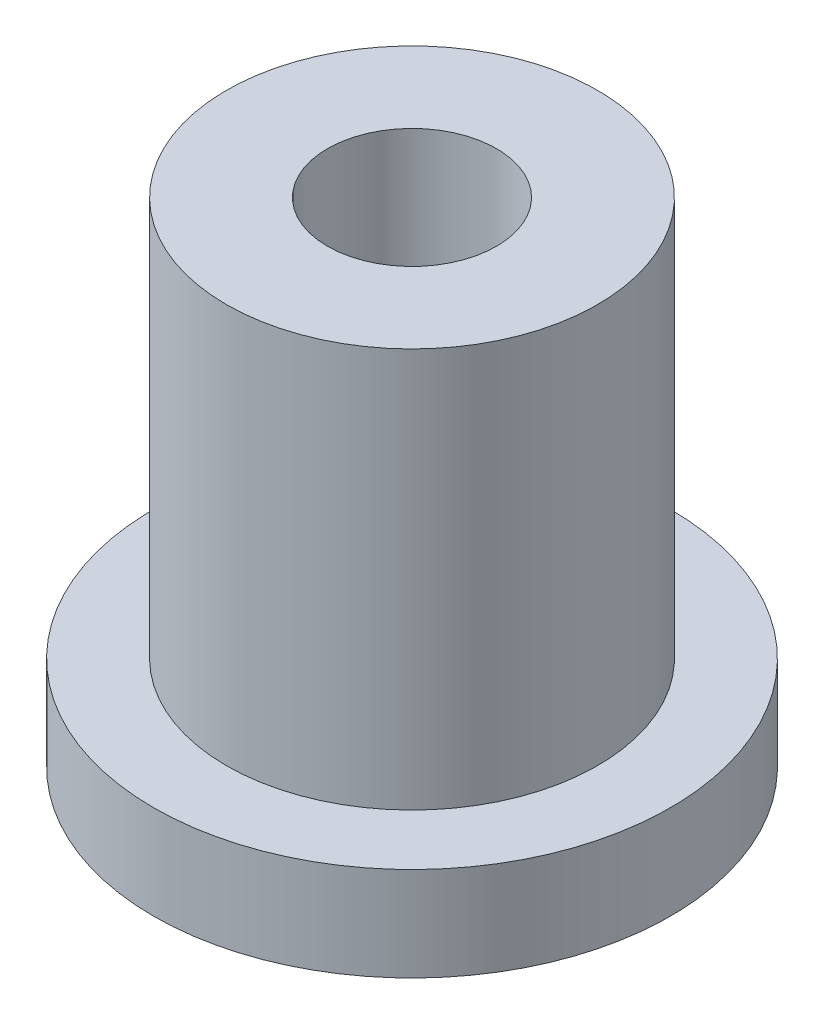
ISO-10303-21;
HEADER;
FILE_DESCRIPTION(('STEP AP214'),'2;1');
FILE_NAME('part.step','',(''),(''),'','','');
FILE_SCHEMA(('AUTOMOTIVE_DESIGN { 1 0 10303 214 1 1 1 1 }'));
ENDSEC;
DATA;
#1=APPLICATION_CONTEXT('core data for automotive mechanical design processes');
#2=APPLICATION_PROTOCOL_DEFINITION('international standard','automotive_design',2000,#1);
#3=PRODUCT_CONTEXT('',#1,'mechanical');
#4=PRODUCT('Part','Part','',(#3));
#5=PRODUCT_RELATED_PRODUCT_CATEGORY('part','',(#4));
#6=PRODUCT_DEFINITION_FORMATION('','',#4);
#7=PRODUCT_DEFINITION_CONTEXT('part definition',#1,'design');
#8=PRODUCT_DEFINITION('design','',#6,#7);
#9=PRODUCT_DEFINITION_SHAPE('','',#8);
#10=(LENGTH_UNIT() NAMED_UNIT(*) SI_UNIT(.MILLI.,.METRE.));
#11=(NAMED_UNIT(*) PLANE_ANGLE_UNIT() SI_UNIT($,.RADIAN.));
#12=(NAMED_UNIT(*) SI_UNIT($,.STERADIAN.) SOLID_ANGLE_UNIT());
#13=UNCERTAINTY_MEASURE_WITH_UNIT(LENGTH_MEASURE(1.E-05),#10,'distance_accuracy_value','');
#14=(GEOMETRIC_REPRESENTATION_CONTEXT(3) GLOBAL_UNCERTAINTY_ASSIGNED_CONTEXT((#13)) GLOBAL_UNIT_ASSIGNED_CONTEXT((#10,
#11,#12)) REPRESENTATION_CONTEXT('',''));
#15=CARTESIAN_POINT('',(0.,0.,0.));
#16=DIRECTION('',(0.,0.,1.));
#17=DIRECTION('',(1.,0.,0.));
#18=AXIS2_PLACEMENT_3D('',#15,#16,#17);
#19=CARTESIAN_POINT('',(0.,2.,0.));
#20=DIRECTION('',(0.,1.,0.));
#21=DIRECTION('',(0.,0.,1.));
#22=AXIS2_PLACEMENT_3D('',#19,#20,#21);
#23=PLANE('',#22);
#24=CARTESIAN_POINT('',(0.,2.,0.));
#25=DIRECTION('',(0.,1.,0.));
#26=DIRECTION('',(0.,0.,1.));
#27=AXIS2_PLACEMENT_3D('',#24,#25,#26);
#28=CIRCLE('',#27,3.95);
#29=CARTESIAN_POINT('',(0.,2.,3.95));
#30=VERTEX_POINT('',#29);
#31=EDGE_CURVE('E10',#30,#30,#28,.T.);
#32=ORIENTED_EDGE('',*,*,#31,.F.);
#33=EDGE_LOOP('',(#32));
#34=FACE_BOUND('',#33,.T.);
#35=CARTESIAN_POINT('',(0.,2.,0.));
#36=DIRECTION('',(0.,1.,0.));
#37=DIRECTION('',(0.,0.,1.));
#38=AXIS2_PLACEMENT_3D('',#35,#36,#37);
#39=CIRCLE('',#38,5.5);
#40=CARTESIAN_POINT('',(0.,2.,5.5));
#41=VERTEX_POINT('',#40);
#42=EDGE_CURVE('E46',#41,#41,#39,.T.);
#43=ORIENTED_EDGE('',*,*,#42,.T.);
#44=EDGE_LOOP('',(#43));
#45=FACE_BOUND('',#44,.T.);
#46=ADVANCED_FACE('F37',(#34,#45),#23,.T.);
#47=CARTESIAN_POINT('',(0.,0.,0.));
#48=DIRECTION('',(0.,1.,0.));
#49=DIRECTION('',(0.,0.,1.));
#50=AXIS2_PLACEMENT_3D('',#47,#48,#49);
#51=PLANE('',#50);
#52=CARTESIAN_POINT('',(0.,0.,0.));
#53=DIRECTION('',(0.,1.,0.));
#54=DIRECTION('',(0.,0.,1.));
#55=AXIS2_PLACEMENT_3D('',#52,#53,#54);
#56=CIRCLE('',#55,5.5);
#57=CARTESIAN_POINT('',(0.,0.,5.5));
#58=VERTEX_POINT('',#57);
#59=EDGE_CURVE('E41',#58,#58,#56,.T.);
#60=ORIENTED_EDGE('',*,*,#59,.F.);
#61=EDGE_LOOP('',(#60));
#62=FACE_BOUND('',#61,.T.);
#63=CARTESIAN_POINT('',(0.,0.,0.));
#64=DIRECTION('',(0.,1.,0.));
#65=DIRECTION('',(0.,0.,1.));
#66=AXIS2_PLACEMENT_3D('',#63,#64,#65);
#67=CIRCLE('',#66,1.8);
#68=CARTESIAN_POINT('',(0.,0.,1.8));
#69=VERTEX_POINT('',#68);
#70=EDGE_CURVE('E56',#69,#69,#67,.T.);
#71=ORIENTED_EDGE('',*,*,#70,.T.);
#72=EDGE_LOOP('',(#71));
#73=FACE_BOUND('',#72,.T.);
#74=ADVANCED_FACE('F87',(#62,#73),#51,.F.);
#75=CARTESIAN_POINT('',(0.,2.,0.));
#76=DIRECTION('',(0.,-1.,0.));
#77=DIRECTION('',(0.,0.,-1.));
#78=AXIS2_PLACEMENT_3D('',#75,#76,#77);
#79=CYLINDRICAL_SURFACE('',#78,5.5);
#80=ORIENTED_EDGE('',*,*,#42,.F.);
#81=EDGE_LOOP('',(#80));
#82=FACE_BOUND('',#81,.T.);
#83=ORIENTED_EDGE('',*,*,#59,.T.);
#84=EDGE_LOOP('',(#83));
#85=FACE_BOUND('',#84,.T.);
#86=ADVANCED_FACE('F39',(#82,#85),#79,.T.);
#87=CARTESIAN_POINT('',(0.,2.,0.));
#88=DIRECTION('',(0.,-1.,0.));
#89=DIRECTION('',(0.,0.,-1.));
#90=AXIS2_PLACEMENT_3D('',#87,#88,#89);
#91=CYLINDRICAL_SURFACE('',#90,1.8);
#92=ORIENTED_EDGE('',*,*,#70,.F.);
#93=EDGE_LOOP('',(#92));
#94=FACE_BOUND('',#93,.T.);
#95=CARTESIAN_POINT('',(0.,10.5,0.));
#96=DIRECTION('',(0.,1.,0.));
#97=DIRECTION('',(0.,0.,1.));
#98=AXIS2_PLACEMENT_3D('',#95,#96,#97);
#99=CIRCLE('',#98,1.8);
#100=CARTESIAN_POINT('',(0.,10.5,1.8));
#101=VERTEX_POINT('',#100);
#102=EDGE_CURVE('E65',#101,#101,#99,.T.);
#103=ORIENTED_EDGE('',*,*,#102,.T.);
#104=EDGE_LOOP('',(#103));
#105=FACE_BOUND('',#104,.T.);
#106=ADVANCED_FACE('F72',(#94,#105),#91,.F.);
#107=CARTESIAN_POINT('',(0.,10.5,0.));
#108=DIRECTION('',(0.,1.,0.));
#109=DIRECTION('',(0.,0.,1.));
#110=AXIS2_PLACEMENT_3D('',#107,#108,#109);
#111=PLANE('',#110);
#112=CARTESIAN_POINT('',(0.,10.5,0.));
#113=DIRECTION('',(0.,1.,0.));
#114=DIRECTION('',(0.,0.,1.));
#115=AXIS2_PLACEMENT_3D('',#112,#113,#114);
#116=CIRCLE('',#115,3.95);
#117=CARTESIAN_POINT('',(0.,10.5,3.95));
#118=VERTEX_POINT('',#117);
#119=EDGE_CURVE('E54',#118,#118,#116,.T.);
#120=ORIENTED_EDGE('',*,*,#119,.T.);
#121=EDGE_LOOP('',(#120));
#122=FACE_BOUND('',#121,.T.);
#123=ORIENTED_EDGE('',*,*,#102,.F.);
#124=EDGE_LOOP('',(#123));
#125=FACE_BOUND('',#124,.T.);
#126=ADVANCED_FACE('F74',(#122,#125),#111,.T.);
#127=CARTESIAN_POINT('',(0.,10.5,0.));
#128=DIRECTION('',(0.,-1.,0.));
#129=DIRECTION('',(0.,0.,-1.));
#130=AXIS2_PLACEMENT_3D('',#127,#128,#129);
#131=CYLINDRICAL_SURFACE('',#130,3.95);
#132=ORIENTED_EDGE('',*,*,#119,.F.);
#133=EDGE_LOOP('',(#132));
#134=FACE_BOUND('',#133,.T.);
#135=ORIENTED_EDGE('',*,*,#31,.T.);
#136=EDGE_LOOP('',(#135));
#137=FACE_BOUND('',#136,.T.);
#138=ADVANCED_FACE('F76',(#134,#137),#131,.T.);
#139=CLOSED_SHELL('',(#46,#74,#86,#106,#126,#138));
#140=MANIFOLD_SOLID_BREP('B2',#139);
#141=ADVANCED_BREP_SHAPE_REPRESENTATION('',(#18,#140),#14);
#142=SHAPE_DEFINITION_REPRESENTATION(#9,#141);
ENDSEC;
END-ISO-10303-21;
